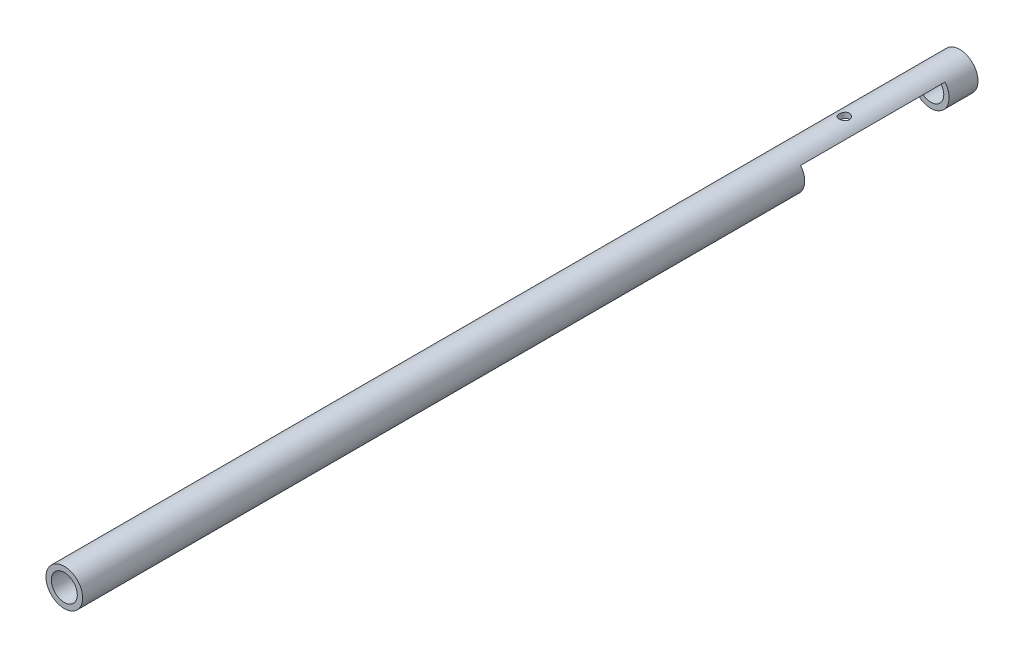
ISO-10303-21;
HEADER;
FILE_DESCRIPTION(('STEP AP214'),'2;1');
FILE_NAME('part.step','',(''),(''),'','','');
FILE_SCHEMA(('AUTOMOTIVE_DESIGN { 1 0 10303 214 1 1 1 1 }'));
ENDSEC;
DATA;
#1=APPLICATION_CONTEXT('core data for automotive mechanical design processes');
#2=APPLICATION_PROTOCOL_DEFINITION('international standard','automotive_design',2000,#1);
#3=PRODUCT_CONTEXT('',#1,'mechanical');
#4=PRODUCT('Part','Part','',(#3));
#5=PRODUCT_RELATED_PRODUCT_CATEGORY('part','',(#4));
#6=PRODUCT_DEFINITION_FORMATION('','',#4);
#7=PRODUCT_DEFINITION_CONTEXT('part definition',#1,'design');
#8=PRODUCT_DEFINITION('design','',#6,#7);
#9=PRODUCT_DEFINITION_SHAPE('','',#8);
#10=(LENGTH_UNIT() NAMED_UNIT(*) SI_UNIT(.MILLI.,.METRE.));
#11=(NAMED_UNIT(*) PLANE_ANGLE_UNIT() SI_UNIT($,.RADIAN.));
#12=(NAMED_UNIT(*) SI_UNIT($,.STERADIAN.) SOLID_ANGLE_UNIT());
#13=UNCERTAINTY_MEASURE_WITH_UNIT(LENGTH_MEASURE(1.E-05),#10,'distance_accuracy_value','');
#14=(GEOMETRIC_REPRESENTATION_CONTEXT(3) GLOBAL_UNCERTAINTY_ASSIGNED_CONTEXT((#13)) GLOBAL_UNIT_ASSIGNED_CONTEXT((#10,
#11,#12)) REPRESENTATION_CONTEXT('',''));
#15=CARTESIAN_POINT('',(0.,0.,0.));
#16=DIRECTION('',(0.,0.,1.));
#17=DIRECTION('',(1.,0.,0.));
#18=AXIS2_PLACEMENT_3D('',#15,#16,#17);
#19=CARTESIAN_POINT('',(0.,0.,35.));
#20=DIRECTION('',(0.,0.,-1.));
#21=DIRECTION('',(-1.,0.,0.));
#22=AXIS2_PLACEMENT_3D('',#19,#20,#21);
#23=CYLINDRICAL_SURFACE('',#22,3.175);
#24=CARTESIAN_POINT('',(0.,3.175,19.111));
#25=CARTESIAN_POINT('',(0.0489157737538371,3.17499936518857,19.1110009592444));
#26=CARTESIAN_POINT('',(0.0978415218299282,3.17385856149939,19.1150507503503));
#27=CARTESIAN_POINT('',(0.194277613152046,3.16941869982885,19.1311104849698));
#28=CARTESIAN_POINT('',(0.241787368037376,3.16611875742134,19.1431236904829));
#29=CARTESIAN_POINT('',(0.333985970836099,3.15772382932597,19.1746845648173));
#30=CARTESIAN_POINT('',(0.378678565700531,3.15263128992258,19.1942219690706));
#31=CARTESIAN_POINT('',(0.464153150691933,3.14118589033194,19.2402370068609));
#32=CARTESIAN_POINT('',(0.504934775786138,3.13483291267042,19.2667152873693));
#33=CARTESIAN_POINT('',(0.582463324273025,3.12136930906929,19.3265684701788));
#34=CARTESIAN_POINT('',(0.619097040879825,3.11424471003712,19.3600868661089));
#35=CARTESIAN_POINT('',(0.686303745395547,3.10012804899674,19.4327624443207));
#36=CARTESIAN_POINT('',(0.716875865353108,3.0931360060985,19.4719204327438));
#37=CARTESIAN_POINT('',(0.771660273705086,3.07993134711162,19.5556881666596));
#38=CARTESIAN_POINT('',(0.795739269537297,3.07373626155939,19.6003881054492));
#39=CARTESIAN_POINT('',(0.835994193086839,3.06303372841595,19.6934037754318));
#40=CARTESIAN_POINT('',(0.852171745640055,3.0585259338984,19.7417187608758));
#41=CARTESIAN_POINT('',(0.875765553832283,3.05185316306032,19.8393322274151));
#42=CARTESIAN_POINT('',(0.883388435468448,3.04963304486604,19.8885769008446));
#43=CARTESIAN_POINT('',(0.890301136120387,3.04762251150207,19.9876923265727));
#44=CARTESIAN_POINT('',(0.889592686927836,3.04783159138713,20.037562946606));
#45=CARTESIAN_POINT('',(0.880026195745625,3.05060666415035,20.1348763542407));
#46=CARTESIAN_POINT('',(0.871421512477314,3.05309938007861,20.1823464756955));
#47=CARTESIAN_POINT('',(0.846713969112882,3.06004305828936,20.2751406465353));
#48=CARTESIAN_POINT('',(0.830610455225394,3.06449419131611,20.3204645084174));
#49=CARTESIAN_POINT('',(0.791163712285433,3.07491527179749,20.4083241473005));
#50=CARTESIAN_POINT('',(0.767734261578673,3.08090314682857,20.4508189963681));
#51=CARTESIAN_POINT('',(0.714360770073068,3.09371379002513,20.5313613931746));
#52=CARTESIAN_POINT('',(0.684415329838221,3.10053673740076,20.5694079828603));
#53=CARTESIAN_POINT('',(0.617578797379305,3.11455075820433,20.6414174761037));
#54=CARTESIAN_POINT('',(0.580475883052376,3.12174622640201,20.6751832198332));
#55=CARTESIAN_POINT('',(0.501045351949359,3.13547454789476,20.7360558875626));
#56=CARTESIAN_POINT('',(0.458717485449031,3.14200736949173,20.7631624931066));
#57=CARTESIAN_POINT('',(0.369712853974137,3.15372159534798,20.8100467212302));
#58=CARTESIAN_POINT('',(0.323014650586877,3.15889580695917,20.8297855611022));
#59=CARTESIAN_POINT('',(0.226783977774741,3.16725795899551,20.8610738265943));
#60=CARTESIAN_POINT('',(0.177252196580585,3.17044637951994,20.8726252317615));
#61=CARTESIAN_POINT('',(0.0784404499677238,3.17440379725836,20.8868939687736));
#62=CARTESIAN_POINT('',(0.0292020197379144,3.17524608915644,20.8898790129495));
#63=CARTESIAN_POINT('',(-0.0690730306447935,3.17462873659145,20.8876738843278));
#64=CARTESIAN_POINT('',(-0.118109673325188,3.17316935648366,20.8824846503755));
#65=CARTESIAN_POINT('',(-0.213612420430054,3.16816025342919,20.8642967632803));
#66=CARTESIAN_POINT('',(-0.260109821187467,3.16465126206612,20.8514501841453));
#67=CARTESIAN_POINT('',(-0.350282967028206,3.15594369765462,20.8184913250906));
#68=CARTESIAN_POINT('',(-0.393958390904349,3.150744932675,20.7983782197812));
#69=CARTESIAN_POINT('',(-0.478266796673959,3.13906619959136,20.750979145328));
#70=CARTESIAN_POINT('',(-0.518816442059785,3.13256157871769,20.7235511768033));
#71=CARTESIAN_POINT('',(-0.594830571157077,3.11902144731138,20.6624770806244));
#72=CARTESIAN_POINT('',(-0.630293941475878,3.11198582105379,20.6288295951874));
#73=CARTESIAN_POINT('',(-0.696277111843983,3.09790229776669,20.5550181703352));
#74=CARTESIAN_POINT('',(-0.726607293994763,3.09086091782641,20.5146831432084));
#75=CARTESIAN_POINT('',(-0.78007624919774,3.07780220325434,20.429344769891));
#76=CARTESIAN_POINT('',(-0.803215290960619,3.07178483036237,20.3843415982185));
#77=CARTESIAN_POINT('',(-0.841473857948893,3.06152566127489,20.2911446642248));
#78=CARTESIAN_POINT('',(-0.85663738514302,3.05727415054671,20.2429700940438));
#79=CARTESIAN_POINT('',(-0.878604076191619,3.05103470564523,20.1446135379661));
#80=CARTESIAN_POINT('',(-0.885409649014234,3.04904611925358,20.0944321347959));
#81=CARTESIAN_POINT('',(-0.890318537347583,3.0476160386931,19.9954383137395));
#82=CARTESIAN_POINT('',(-0.88872820450943,3.04808487304597,19.9466421668126));
#83=CARTESIAN_POINT('',(-0.87760904852206,3.05130466354992,19.8500435233926));
#84=CARTESIAN_POINT('',(-0.868080470943485,3.05405554910544,19.8022409962087));
#85=CARTESIAN_POINT('',(-0.841541065868859,3.06147339467581,19.7094165096867));
#86=CARTESIAN_POINT('',(-0.824601422375377,3.06612209823446,19.664372634654));
#87=CARTESIAN_POINT('',(-0.783775785662918,3.07681065069981,19.5777310947424));
#88=CARTESIAN_POINT('',(-0.759888604353125,3.08285073750866,19.5361340208619));
#89=CARTESIAN_POINT('',(-0.704944037229981,3.09588424541818,19.4561201327998));
#90=CARTESIAN_POINT('',(-0.673680626237014,3.10290209243824,19.417848760727));
#91=CARTESIAN_POINT('',(-0.605254714532243,3.11697124976766,19.346996028609));
#92=CARTESIAN_POINT('',(-0.568090747171243,3.1240225679728,19.3144160874723));
#93=CARTESIAN_POINT('',(-0.48782885911546,3.13756945243037,19.255087774026));
#94=CARTESIAN_POINT('',(-0.444608622335948,3.14404733581471,19.2285004654987));
#95=CARTESIAN_POINT('',(-0.354130776281865,3.15551736196215,19.1830098819456));
#96=CARTESIAN_POINT('',(-0.306875512094536,3.16051036025107,19.1641021799607));
#97=CARTESIAN_POINT('',(-0.216568135388878,3.16788227398237,19.136679827279));
#98=CARTESIAN_POINT('',(-0.173866502868505,3.17053098906548,19.1270736467991));
#99=CARTESIAN_POINT('',(-0.0874458203594979,3.17409002955725,19.1142336939068));
#100=CARTESIAN_POINT('',(-0.0437268954046189,3.17500056747202,19.1109991425101));
#101=CARTESIAN_POINT('',(0.,3.175,19.111));
#102=B_SPLINE_CURVE_WITH_KNOTS('',3,(#24,#25,#26,#27,#28,#29,#30,#31,#32,#33,#34,#35,#36,#37,
#38,#39,#40,#41,#42,#43,#44,#45,#46,#47,#48,#49,#50,#51,#52,#53,#54,#55,#56,#57,#58,#59,#60,#61,
#62,#63,#64,#65,#66,#67,#68,#69,#70,#71,#72,#73,#74,#75,#76,#77,#78,#79,#80,#81,#82,#83,#84,#85,
#86,#87,#88,#89,#90,#91,#92,#93,#94,#95,#96,#97,#98,#99,#100,#101),.UNSPECIFIED.,.T.,.F.,(4,2,2,
2,2,2,2,2,2,2,2,2,2,2,2,2,2,2,2,2,2,2,2,2,2,2,2,2,2,2,2,2,2,2,2,2,2,2,4),(0.,0.14658686375005,
0.293233810016139,0.4396814040625,0.586142653608811,0.735943608929934,0.885765998569644,
1.03846326158802,1.19112911103381,1.34002235519437,1.48888465021514,1.63313147782072,
1.77739088405321,1.92341644964253,2.06947340808295,2.22080635932417,2.37214654625828,
2.52427248983091,2.67636164003826,2.82364307680311,2.97090759899854,3.11534059337548,
3.25978999875989,3.40727830060939,3.55479883873725,3.70693967387804,3.85907482330248,
4.0103615773904,4.16160471667119,4.307368281064,4.45312733640928,4.59751608715414,
4.74192954419329,4.89099085253729,5.04008926990672,5.19281316203596,5.34544889010503,
5.47650216312916,5.60753941281361),.UNSPECIFIED.);
#103=CARTESIAN_POINT('',(0.,3.175,19.111));
#104=VERTEX_POINT('',#103);
#105=EDGE_CURVE('E124',#104,#104,#102,.T.);
#106=ORIENTED_EDGE('',*,*,#105,.T.);
#107=EDGE_LOOP('',(#106));
#108=FACE_BOUND('',#107,.T.);
#109=CARTESIAN_POINT('',(0.,0.,0.));
#110=DIRECTION('',(0.,0.,1.));
#111=DIRECTION('',(1.,0.,0.));
#112=AXIS2_PLACEMENT_3D('',#109,#110,#111);
#113=CIRCLE('',#112,3.175);
#114=CARTESIAN_POINT('',(3.175,0.,0.));
#115=VERTEX_POINT('',#114);
#116=EDGE_CURVE('E108',#115,#115,#113,.T.);
#117=ORIENTED_EDGE('',*,*,#116,.T.);
#118=EDGE_LOOP('',(#117));
#119=FACE_BOUND('',#118,.T.);
#120=DIRECTION('',(0.,0.,-1.));
#121=VECTOR('',#120,1.);
#122=CARTESIAN_POINT('',(-2.46589233341604,2.,35.));
#123=LINE('',#122,#121);
#124=CARTESIAN_POINT('',(-2.46589233341604,2.,30.));
#125=VERTEX_POINT('',#124);
#126=CARTESIAN_POINT('',(-2.46589233341604,2.,5.));
#127=VERTEX_POINT('',#126);
#128=EDGE_CURVE('E94',#125,#127,#123,.T.);
#129=ORIENTED_EDGE('',*,*,#128,.F.);
#130=CARTESIAN_POINT('',(0.,0.,30.));
#131=DIRECTION('',(0.,0.,-1.));
#132=DIRECTION('',(-1.,0.,0.));
#133=AXIS2_PLACEMENT_3D('',#130,#131,#132);
#134=CIRCLE('',#133,3.175);
#135=CARTESIAN_POINT('',(2.46589233341604,2.,30.));
#136=VERTEX_POINT('',#135);
#137=EDGE_CURVE('E80',#136,#125,#134,.T.);
#138=ORIENTED_EDGE('',*,*,#137,.F.);
#139=DIRECTION('',(0.,0.,-1.));
#140=VECTOR('',#139,1.);
#141=CARTESIAN_POINT('',(2.46589233341604,2.,35.));
#142=LINE('',#141,#140);
#143=CARTESIAN_POINT('',(2.46589233341604,2.,5.));
#144=VERTEX_POINT('',#143);
#145=EDGE_CURVE('E100',#144,#136,#142,.F.);
#146=ORIENTED_EDGE('',*,*,#145,.F.);
#147=CARTESIAN_POINT('',(0.,0.,5.));
#148=DIRECTION('',(0.,0.,1.));
#149=DIRECTION('',(1.,0.,0.));
#150=AXIS2_PLACEMENT_3D('',#147,#148,#149);
#151=CIRCLE('',#150,3.175);
#152=EDGE_CURVE('E89',#127,#144,#151,.T.);
#153=ORIENTED_EDGE('',*,*,#152,.F.);
#154=EDGE_LOOP('',(#129,#138,#146,#153));
#155=FACE_BOUND('',#154,.T.);
#156=CARTESIAN_POINT('',(0.,0.,155.));
#157=DIRECTION('',(0.,0.,1.));
#158=DIRECTION('',(1.,0.,0.));
#159=AXIS2_PLACEMENT_3D('',#156,#157,#158);
#160=CIRCLE('',#159,3.175);
#161=CARTESIAN_POINT('',(3.175,0.,155.));
#162=VERTEX_POINT('',#161);
#163=EDGE_CURVE('E129',#162,#162,#160,.T.);
#164=ORIENTED_EDGE('',*,*,#163,.F.);
#165=EDGE_LOOP('',(#164));
#166=FACE_BOUND('',#165,.T.);
#167=ADVANCED_FACE('F35',(#108,#119,#155,#166),#23,.T.);
#168=CARTESIAN_POINT('',(0.,0.,35.));
#169=DIRECTION('',(0.,0.,-1.));
#170=DIRECTION('',(-1.,0.,0.));
#171=AXIS2_PLACEMENT_3D('',#168,#169,#170);
#172=CYLINDRICAL_SURFACE('',#171,2.25);
#173=CARTESIAN_POINT('',(0.,2.25,19.111));
#174=CARTESIAN_POINT('',(0.0478398723383245,2.24999642041182,19.1110049188907));
#175=CARTESIAN_POINT('',(0.0957506672676521,2.24845668012679,19.114883557909));
#176=CARTESIAN_POINT('',(0.190221267769569,2.24244747306642,19.130264853265));
#177=CARTESIAN_POINT('',(0.236777323469745,2.23797055775579,19.1417868937319));
#178=CARTESIAN_POINT('',(0.32702499176611,2.22657051309372,19.1719714334575));
#179=CARTESIAN_POINT('',(0.370725165044792,2.21965513339145,19.1906113269558));
#180=CARTESIAN_POINT('',(0.454342188437475,2.20406093577549,19.2344131617561));
#181=CARTESIAN_POINT('',(0.494260172854911,2.19538264903974,19.2595731391329));
#182=CARTESIAN_POINT('',(0.57107526146796,2.17669501707831,19.3169282497832));
#183=CARTESIAN_POINT('',(0.607774729742669,2.16664504347125,19.3493747425754));
#184=CARTESIAN_POINT('',(0.675377247199738,2.1465348746819,19.4198511086233));
#185=CARTESIAN_POINT('',(0.706277608594103,2.13647467692202,19.4578835563889));
#186=CARTESIAN_POINT('',(0.762718516173495,2.11700062398601,19.540448461911));
#187=CARTESIAN_POINT('',(0.787969917739819,2.10763345292839,19.5851907156467));
#188=CARTESIAN_POINT('',(0.83050064093009,2.09124175938907,19.6787134662592));
#189=CARTESIAN_POINT('',(0.847783630184449,2.08421615956313,19.7274920930914));
#190=CARTESIAN_POINT('',(0.873092066446922,2.07373851023206,19.8254327510421));
#191=CARTESIAN_POINT('',(0.8814953663166,2.07014130554495,19.8744810552486));
#192=CARTESIAN_POINT('',(0.889986465617352,2.06650614341733,19.9734133183535));
#193=CARTESIAN_POINT('',(0.890078223308299,2.06646649174025,20.0232968681563));
#194=CARTESIAN_POINT('',(0.882230509619896,2.0698268146007,20.118888453543));
#195=CARTESIAN_POINT('',(0.874833606968666,2.07299441864743,20.1646507733817));
#196=CARTESIAN_POINT('',(0.853121666829546,2.08202309960937,20.2542222050264));
#197=CARTESIAN_POINT('',(0.838805454041105,2.08788463410206,20.2980309836265));
#198=CARTESIAN_POINT('',(0.803391175822082,2.10176812965172,20.3834931311831));
#199=CARTESIAN_POINT('',(0.782162373869962,2.10983121079461,20.4250853476863));
#200=CARTESIAN_POINT('',(0.733617166463289,2.12719751039505,20.504267322912));
#201=CARTESIAN_POINT('',(0.70629851001786,2.13650118690117,20.5418555940455));
#202=CARTESIAN_POINT('',(0.643931528667488,2.15615348759746,20.6149394953204));
#203=CARTESIAN_POINT('',(0.608456198032144,2.16652805734753,20.6500647187967));
#204=CARTESIAN_POINT('',(0.532006144693586,2.18655655523704,20.7139842704013));
#205=CARTESIAN_POINT('',(0.49103038152178,2.19621034649416,20.7427773980173));
#206=CARTESIAN_POINT('',(0.403713254880695,2.21394094411916,20.7936856363276));
#207=CARTESIAN_POINT('',(0.35728529459066,2.22198458656052,20.8156646053494));
#208=CARTESIAN_POINT('',(0.260992790610447,2.23533884969376,20.8513735503319));
#209=CARTESIAN_POINT('',(0.211129962397316,2.24065082360189,20.8651076112275));
#210=CARTESIAN_POINT('',(0.112490490430763,2.24769836049677,20.8831951950385));
#211=CARTESIAN_POINT('',(0.063818652900256,2.24962352764859,20.8880466977693));
#212=CARTESIAN_POINT('',(-0.0336768627121359,2.25027552383453,20.8896977926471));
#213=CARTESIAN_POINT('',(-0.0825004995258711,2.24900315715881,20.8864994096179));
#214=CARTESIAN_POINT('',(-0.17667765813729,2.24352739827099,20.8725102613804));
#215=CARTESIAN_POINT('',(-0.222089658715954,2.23945424241114,20.8620566685169));
#216=CARTESIAN_POINT('',(-0.310475203933488,2.22892070466763,20.8343096443171));
#217=CARTESIAN_POINT('',(-0.353448433440081,2.22246001507902,20.8170153313296));
#218=CARTESIAN_POINT('',(-0.437205051408387,2.20753646045423,20.7755150645101));
#219=CARTESIAN_POINT('',(-0.47788217556049,2.19901870703218,20.7511150051316));
#220=CARTESIAN_POINT('',(-0.554706410981551,2.18090832580639,20.6963119575716));
#221=CARTESIAN_POINT('',(-0.590851722648417,2.17131527384306,20.6659065969245));
#222=CARTESIAN_POINT('',(-0.660028298562478,2.15133487592016,20.5976567370811));
#223=CARTESIAN_POINT('',(-0.692708821452659,2.14093617969684,20.5594591283253));
#224=CARTESIAN_POINT('',(-0.751278849352397,2.12109380704183,20.477933568094));
#225=CARTESIAN_POINT('',(-0.777167348177903,2.11165027223684,20.4346048578652));
#226=CARTESIAN_POINT('',(-0.821552193888355,2.09478478792087,20.3434568244135));
#227=CARTESIAN_POINT('',(-0.83998395244984,2.08738067202609,20.2956025168091));
#228=CARTESIAN_POINT('',(-0.868389065586719,2.07572653589133,20.1970897167626));
#229=CARTESIAN_POINT('',(-0.878368452800812,2.07147426638214,20.1464332518362));
#230=CARTESIAN_POINT('',(-0.889016060281986,2.06692545691172,20.0476002217912));
#231=CARTESIAN_POINT('',(-0.890290823270716,2.06637129790745,19.9995004253827));
#232=CARTESIAN_POINT('',(-0.885078048293269,2.06860939973702,19.9038074339402));
#233=CARTESIAN_POINT('',(-0.878591439043222,2.07140126019039,19.8562141789815));
#234=CARTESIAN_POINT('',(-0.858530993528368,2.07979207156192,19.7647175980114));
#235=CARTESIAN_POINT('',(-0.845233112692836,2.08528140730621,19.7207428117206));
#236=CARTESIAN_POINT('',(-0.812182740258942,2.09837401472952,19.6356294301135));
#237=CARTESIAN_POINT('',(-0.792428542190309,2.10597784521165,19.5944915881155));
#238=CARTESIAN_POINT('',(-0.74573952063945,2.12297482132835,19.5136958906077));
#239=CARTESIAN_POINT('',(-0.718462897335004,2.13244463097201,19.4742519317782));
#240=CARTESIAN_POINT('',(-0.658006802843993,2.15186758496926,19.4003080807491));
#241=CARTESIAN_POINT('',(-0.624825244411693,2.16182089932213,19.3658099445842));
#242=CARTESIAN_POINT('',(-0.551023771334748,2.18183933851293,19.3005214365356));
#243=CARTESIAN_POINT('',(-0.510067765107162,2.19187229141605,19.2700995388944));
#244=CARTESIAN_POINT('',(-0.423260344934794,2.21027475722013,19.216565521856));
#245=CARTESIAN_POINT('',(-0.37740830066378,2.21864405554084,19.1934543451777));
#246=CARTESIAN_POINT('',(-0.28614722944711,2.23216602849022,19.1570012253445));
#247=CARTESIAN_POINT('',(-0.241034974389006,2.23753241233658,19.142993386181));
#248=CARTESIAN_POINT('',(-0.149005747552302,2.24553219880932,19.1223157797337));
#249=CARTESIAN_POINT('',(-0.102094091024705,2.24817309119143,19.1156258993643));
#250=CARTESIAN_POINT('',(-0.0366772762998041,2.24977688597913,19.1115657744087));
#251=CARTESIAN_POINT('',(-0.018343851965265,2.25000137256712,19.110998113887));
#252=CARTESIAN_POINT('',(0.,2.25,19.111));
#253=B_SPLINE_CURVE_WITH_KNOTS('',3,(#173,#174,#175,#176,#177,#178,#179,#180,#181,#182,#183,
#184,#185,#186,#187,#188,#189,#190,#191,#192,#193,#194,#195,#196,#197,#198,#199,#200,#201,#202,
#203,#204,#205,#206,#207,#208,#209,#210,#211,#212,#213,#214,#215,#216,#217,#218,#219,#220,#221,
#222,#223,#224,#225,#226,#227,#228,#229,#230,#231,#232,#233,#234,#235,#236,#237,#238,#239,#240,
#241,#242,#243,#244,#245,#246,#247,#248,#249,#250,#251,#252),.UNSPECIFIED.,.T.,.F.,(4,2,2,2,2,2,
2,2,2,2,2,2,2,2,2,2,2,2,2,2,2,2,2,2,2,2,2,2,2,2,2,2,2,2,2,2,2,2,2,4),(0.,0.143464988498424,
0.287295210989369,0.430672388463881,0.574006429159221,0.723368224212225,0.872799075883499,
1.0286840955077,1.18449729394853,1.33337444596648,1.4821806968756,1.62092621718622,
1.7596953128277,1.90125825523439,2.04287361052384,2.19514715663015,2.34744954768504,
2.50262343140361,2.65772037072365,2.80381949683094,2.94988187764246,3.0895747420716,
3.22928561637612,3.37324309039321,3.51725755068635,3.67055189966419,3.82386894516731,
3.97848692624657,4.13299445994164,4.27661496905509,4.42021829443589,4.55841634944532,
4.69665096118502,4.84267223442865,4.98874522540609,5.14398381432956,5.29924241314709,
5.44123774092245,5.58284181256054,5.637852421548),.UNSPECIFIED.);
#254=CARTESIAN_POINT('',(0.,2.25,19.111));
#255=VERTEX_POINT('',#254);
#256=EDGE_CURVE('E39',#255,#255,#253,.T.);
#257=ORIENTED_EDGE('',*,*,#256,.F.);
#258=EDGE_LOOP('',(#257));
#259=FACE_BOUND('',#258,.T.);
#260=CARTESIAN_POINT('',(0.,0.,0.));
#261=DIRECTION('',(0.,0.,1.));
#262=DIRECTION('',(1.,0.,0.));
#263=AXIS2_PLACEMENT_3D('',#260,#261,#262);
#264=CIRCLE('',#263,2.25);
#265=CARTESIAN_POINT('',(2.25,0.,0.));
#266=VERTEX_POINT('',#265);
#267=EDGE_CURVE('E88',#266,#266,#264,.T.);
#268=ORIENTED_EDGE('',*,*,#267,.F.);
#269=EDGE_LOOP('',(#268));
#270=FACE_BOUND('',#269,.T.);
#271=CARTESIAN_POINT('',(0.,0.,30.));
#272=DIRECTION('',(0.,0.,-1.));
#273=DIRECTION('',(-1.,0.,0.));
#274=AXIS2_PLACEMENT_3D('',#271,#272,#273);
#275=CIRCLE('',#274,2.25);
#276=CARTESIAN_POINT('',(1.03077640640441,2.,30.));
#277=VERTEX_POINT('',#276);
#278=CARTESIAN_POINT('',(-1.03077640640442,2.,30.));
#279=VERTEX_POINT('',#278);
#280=EDGE_CURVE('E48',#277,#279,#275,.T.);
#281=ORIENTED_EDGE('',*,*,#280,.T.);
#282=DIRECTION('',(0.,0.,-1.));
#283=VECTOR('',#282,1.);
#284=CARTESIAN_POINT('',(-1.03077640640441,2.,35.));
#285=LINE('',#284,#283);
#286=CARTESIAN_POINT('',(-1.03077640640442,2.,5.));
#287=VERTEX_POINT('',#286);
#288=EDGE_CURVE('E11',#279,#287,#285,.T.);
#289=ORIENTED_EDGE('',*,*,#288,.T.);
#290=CARTESIAN_POINT('',(0.,0.,5.));
#291=DIRECTION('',(0.,0.,1.));
#292=DIRECTION('',(1.,0.,0.));
#293=AXIS2_PLACEMENT_3D('',#290,#291,#292);
#294=CIRCLE('',#293,2.25);
#295=CARTESIAN_POINT('',(1.03077640640442,2.,5.));
#296=VERTEX_POINT('',#295);
#297=EDGE_CURVE('E114',#287,#296,#294,.T.);
#298=ORIENTED_EDGE('',*,*,#297,.T.);
#299=DIRECTION('',(0.,0.,-1.));
#300=VECTOR('',#299,1.);
#301=CARTESIAN_POINT('',(1.03077640640441,2.,35.));
#302=LINE('',#301,#300);
#303=EDGE_CURVE('E111',#296,#277,#302,.F.);
#304=ORIENTED_EDGE('',*,*,#303,.T.);
#305=EDGE_LOOP('',(#281,#289,#298,#304));
#306=FACE_BOUND('',#305,.T.);
#307=CARTESIAN_POINT('',(0.,0.,155.));
#308=DIRECTION('',(0.,0.,1.));
#309=DIRECTION('',(1.,0.,0.));
#310=AXIS2_PLACEMENT_3D('',#307,#308,#309);
#311=CIRCLE('',#310,2.25);
#312=CARTESIAN_POINT('',(2.25,0.,155.));
#313=VERTEX_POINT('',#312);
#314=EDGE_CURVE('E227',#313,#313,#311,.T.);
#315=ORIENTED_EDGE('',*,*,#314,.T.);
#316=EDGE_LOOP('',(#315));
#317=FACE_BOUND('',#316,.T.);
#318=ADVANCED_FACE('F118',(#259,#270,#306,#317),#172,.F.);
#319=CARTESIAN_POINT('',(0.,0.,0.));
#320=DIRECTION('',(0.,0.,1.));
#321=DIRECTION('',(1.,0.,0.));
#322=AXIS2_PLACEMENT_3D('',#319,#320,#321);
#323=PLANE('',#322);
#324=ORIENTED_EDGE('',*,*,#116,.F.);
#325=EDGE_LOOP('',(#324));
#326=FACE_BOUND('',#325,.T.);
#327=ORIENTED_EDGE('',*,*,#267,.T.);
#328=EDGE_LOOP('',(#327));
#329=FACE_BOUND('',#328,.T.);
#330=ADVANCED_FACE('F144',(#326,#329),#323,.F.);
#331=CARTESIAN_POINT('',(-5.52814222695019,2.,30.));
#332=DIRECTION('',(0.,0.,-1.));
#333=DIRECTION('',(-1.,0.,0.));
#334=AXIS2_PLACEMENT_3D('',#331,#332,#333);
#335=PLANE('',#334);
#336=ORIENTED_EDGE('',*,*,#137,.T.);
#337=DIRECTION('',(1.,0.,0.));
#338=VECTOR('',#337,1.);
#339=CARTESIAN_POINT('',(-5.52814222695019,2.,30.));
#340=LINE('',#339,#338);
#341=EDGE_CURVE('E83',#125,#279,#340,.T.);
#342=ORIENTED_EDGE('',*,*,#341,.T.);
#343=ORIENTED_EDGE('',*,*,#280,.F.);
#344=EDGE_CURVE('E60',#277,#136,#340,.T.);
#345=ORIENTED_EDGE('',*,*,#344,.T.);
#346=EDGE_LOOP('',(#336,#342,#343,#345));
#347=FACE_BOUND('',#346,.T.);
#348=ADVANCED_FACE('F82',(#347),#335,.T.);
#349=CARTESIAN_POINT('',(-5.52814222695019,2.,5.));
#350=DIRECTION('',(0.,0.,1.));
#351=DIRECTION('',(1.,0.,0.));
#352=AXIS2_PLACEMENT_3D('',#349,#350,#351);
#353=PLANE('',#352);
#354=ORIENTED_EDGE('',*,*,#152,.T.);
#355=DIRECTION('',(-1.,0.,0.));
#356=VECTOR('',#355,1.);
#357=CARTESIAN_POINT('',(-5.52814222695019,2.,5.));
#358=LINE('',#357,#356);
#359=EDGE_CURVE('E55',#144,#296,#358,.T.);
#360=ORIENTED_EDGE('',*,*,#359,.T.);
#361=ORIENTED_EDGE('',*,*,#297,.F.);
#362=EDGE_CURVE('E96',#287,#127,#358,.T.);
#363=ORIENTED_EDGE('',*,*,#362,.T.);
#364=EDGE_LOOP('',(#354,#360,#361,#363));
#365=FACE_BOUND('',#364,.T.);
#366=ADVANCED_FACE('F122',(#365),#353,.T.);
#367=CARTESIAN_POINT('',(0.,2.,0.));
#368=DIRECTION('',(0.,-1.,0.));
#369=DIRECTION('',(0.,0.,-1.));
#370=AXIS2_PLACEMENT_3D('',#367,#368,#369);
#371=PLANE('',#370);
#372=ORIENTED_EDGE('',*,*,#128,.T.);
#373=ORIENTED_EDGE('',*,*,#362,.F.);
#374=ORIENTED_EDGE('',*,*,#288,.F.);
#375=ORIENTED_EDGE('',*,*,#341,.F.);
#376=EDGE_LOOP('',(#372,#373,#374,#375));
#377=FACE_BOUND('',#376,.T.);
#378=ADVANCED_FACE('F92',(#377),#371,.T.);
#379=ORIENTED_EDGE('',*,*,#145,.T.);
#380=ORIENTED_EDGE('',*,*,#344,.F.);
#381=ORIENTED_EDGE('',*,*,#303,.F.);
#382=ORIENTED_EDGE('',*,*,#359,.F.);
#383=EDGE_LOOP('',(#379,#380,#381,#382));
#384=FACE_BOUND('',#383,.T.);
#385=ADVANCED_FACE('F120',(#384),#371,.T.);
#386=CARTESIAN_POINT('',(0.,5.,20.));
#387=DIRECTION('',(0.,-1.,0.));
#388=DIRECTION('',(0.,0.,-1.));
#389=AXIS2_PLACEMENT_3D('',#386,#387,#388);
#390=CYLINDRICAL_SURFACE('',#389,0.889000000000001);
#391=ORIENTED_EDGE('',*,*,#256,.T.);
#392=EDGE_LOOP('',(#391));
#393=FACE_BOUND('',#392,.T.);
#394=ORIENTED_EDGE('',*,*,#105,.F.);
#395=EDGE_LOOP('',(#394));
#396=FACE_BOUND('',#395,.T.);
#397=ADVANCED_FACE('F131',(#393,#396),#390,.F.);
#398=CARTESIAN_POINT('',(0.,0.,155.));
#399=DIRECTION('',(0.,0.,1.));
#400=DIRECTION('',(1.,0.,0.));
#401=AXIS2_PLACEMENT_3D('',#398,#399,#400);
#402=PLANE('',#401);
#403=ORIENTED_EDGE('',*,*,#163,.T.);
#404=EDGE_LOOP('',(#403));
#405=FACE_BOUND('',#404,.T.);
#406=ORIENTED_EDGE('',*,*,#314,.F.);
#407=EDGE_LOOP('',(#406));
#408=FACE_BOUND('',#407,.T.);
#409=ADVANCED_FACE('F136',(#405,#408),#402,.T.);
#410=CLOSED_SHELL('',(#167,#318,#330,#348,#366,#378,#385,#397,#409));
#411=MANIFOLD_SOLID_BREP('B2',#410);
#412=ADVANCED_BREP_SHAPE_REPRESENTATION('',(#18,#411),#14);
#413=SHAPE_DEFINITION_REPRESENTATION(#9,#412);
ENDSEC;
END-ISO-10303-21;
